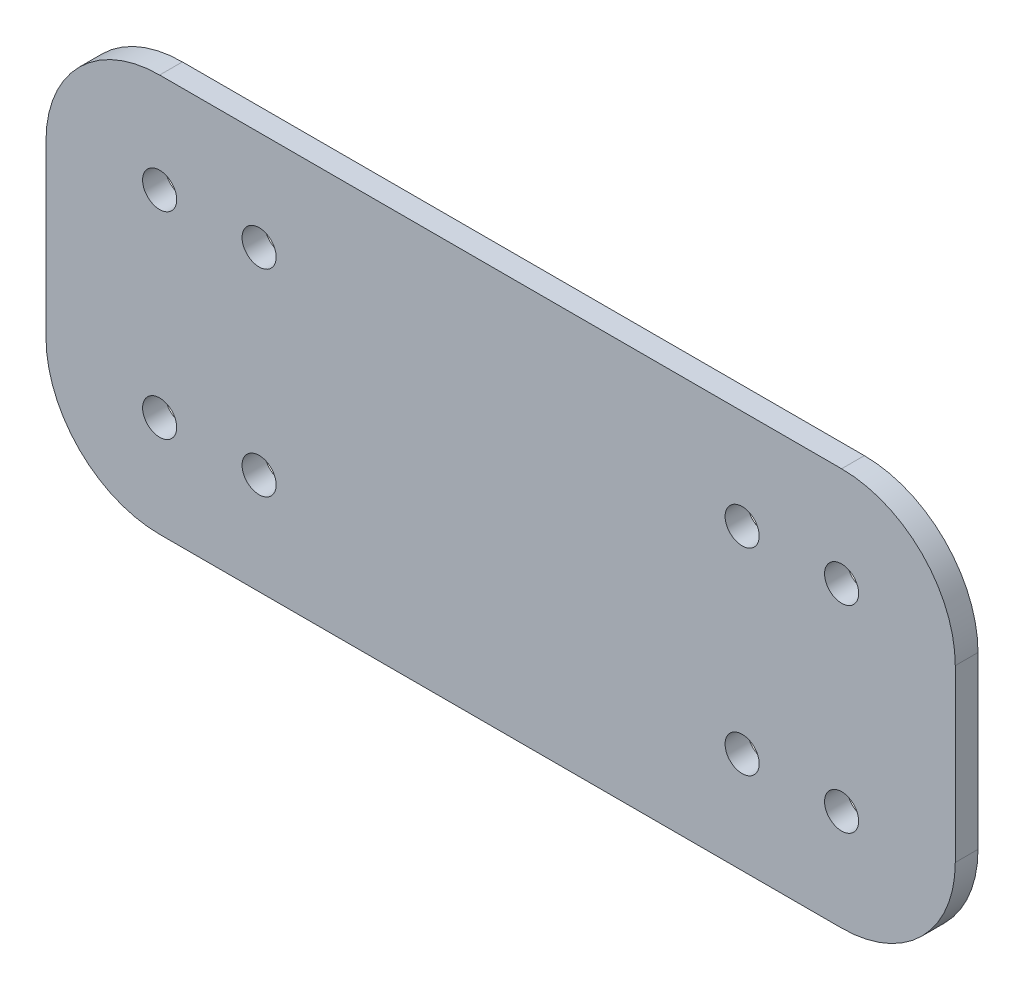
ISO-10303-21;
HEADER;
FILE_DESCRIPTION(('STEP AP214'),'2;1');
FILE_NAME('part.step','',(''),(''),'','','');
FILE_SCHEMA(('AUTOMOTIVE_DESIGN { 1 0 10303 214 1 1 1 1 }'));
ENDSEC;
DATA;
#1=APPLICATION_CONTEXT('core data for automotive mechanical design processes');
#2=APPLICATION_PROTOCOL_DEFINITION('international standard','automotive_design',2000,#1);
#3=PRODUCT_CONTEXT('',#1,'mechanical');
#4=PRODUCT('Part','Part','',(#3));
#5=PRODUCT_RELATED_PRODUCT_CATEGORY('part','',(#4));
#6=PRODUCT_DEFINITION_FORMATION('','',#4);
#7=PRODUCT_DEFINITION_CONTEXT('part definition',#1,'design');
#8=PRODUCT_DEFINITION('design','',#6,#7);
#9=PRODUCT_DEFINITION_SHAPE('','',#8);
#10=(LENGTH_UNIT() NAMED_UNIT(*) SI_UNIT(.MILLI.,.METRE.));
#11=(NAMED_UNIT(*) PLANE_ANGLE_UNIT() SI_UNIT($,.RADIAN.));
#12=(NAMED_UNIT(*) SI_UNIT($,.STERADIAN.) SOLID_ANGLE_UNIT());
#13=UNCERTAINTY_MEASURE_WITH_UNIT(LENGTH_MEASURE(1.E-05),#10,'distance_accuracy_value','');
#14=(GEOMETRIC_REPRESENTATION_CONTEXT(3) GLOBAL_UNCERTAINTY_ASSIGNED_CONTEXT((#13)) GLOBAL_UNIT_ASSIGNED_CONTEXT((#10,
#11,#12)) REPRESENTATION_CONTEXT('',''));
#15=CARTESIAN_POINT('',(0.,0.,0.));
#16=DIRECTION('',(0.,0.,1.));
#17=DIRECTION('',(1.,0.,0.));
#18=AXIS2_PLACEMENT_3D('',#15,#16,#17);
#19=CARTESIAN_POINT('',(9.63963259722495,-2.62960067748029,2.));
#20=DIRECTION('',(0.,0.,-1.));
#21=DIRECTION('',(-1.,0.,0.));
#22=AXIS2_PLACEMENT_3D('',#19,#20,#21);
#23=CYLINDRICAL_SURFACE('',#22,10.);
#24=CARTESIAN_POINT('',(9.63963259722495,-2.62960067748029,0.));
#25=DIRECTION('',(0.,0.,1.));
#26=DIRECTION('',(-1.,0.,0.));
#27=AXIS2_PLACEMENT_3D('',#24,#25,#26);
#28=CIRCLE('',#27,10.);
#29=CARTESIAN_POINT('',(9.63963259722495,-12.6296006774803,0.));
#30=VERTEX_POINT('',#29);
#31=CARTESIAN_POINT('',(19.639632597225,-2.62960067748029,0.));
#32=VERTEX_POINT('',#31);
#33=EDGE_CURVE('E140',#30,#32,#28,.T.);
#34=ORIENTED_EDGE('',*,*,#33,.T.);
#35=DIRECTION('',(0.,0.,-1.));
#36=VECTOR('',#35,1.);
#37=CARTESIAN_POINT('',(19.639632597225,-2.62960067748029,2.));
#38=LINE('',#37,#36);
#39=CARTESIAN_POINT('',(19.639632597225,-2.62960067748029,2.));
#40=VERTEX_POINT('',#39);
#41=EDGE_CURVE('E11',#40,#32,#38,.T.);
#42=ORIENTED_EDGE('',*,*,#41,.F.);
#43=CARTESIAN_POINT('',(9.63963259722495,-2.62960067748029,2.));
#44=DIRECTION('',(0.,0.,1.));
#45=DIRECTION('',(-1.,0.,0.));
#46=AXIS2_PLACEMENT_3D('',#43,#44,#45);
#47=CIRCLE('',#46,10.);
#48=CARTESIAN_POINT('',(9.63963259722495,-12.6296006774803,2.));
#49=VERTEX_POINT('',#48);
#50=EDGE_CURVE('E163',#49,#40,#47,.T.);
#51=ORIENTED_EDGE('',*,*,#50,.F.);
#52=DIRECTION('',(0.,0.,-1.));
#53=VECTOR('',#52,1.);
#54=CARTESIAN_POINT('',(9.63963259722495,-12.6296006774803,2.));
#55=LINE('',#54,#53);
#56=EDGE_CURVE('E136',#49,#30,#55,.T.);
#57=ORIENTED_EDGE('',*,*,#56,.T.);
#58=EDGE_LOOP('',(#34,#42,#51,#57));
#59=FACE_BOUND('',#58,.T.);
#60=ADVANCED_FACE('F39',(#59),#23,.T.);
#61=CARTESIAN_POINT('',(19.639632597225,12.3703993225196,2.));
#62=DIRECTION('',(-1.,0.,0.));
#63=DIRECTION('',(0.,0.,1.));
#64=AXIS2_PLACEMENT_3D('',#61,#62,#63);
#65=PLANE('',#64);
#66=DIRECTION('',(0.,1.,0.));
#67=VECTOR('',#66,1.);
#68=CARTESIAN_POINT('',(19.639632597225,12.3703993225196,0.));
#69=LINE('',#68,#67);
#70=CARTESIAN_POINT('',(19.639632597225,12.3703993225196,0.));
#71=VERTEX_POINT('',#70);
#72=EDGE_CURVE('E144',#32,#71,#69,.T.);
#73=ORIENTED_EDGE('',*,*,#72,.T.);
#74=DIRECTION('',(0.,0.,-1.));
#75=VECTOR('',#74,1.);
#76=CARTESIAN_POINT('',(19.639632597225,12.3703993225196,2.));
#77=LINE('',#76,#75);
#78=CARTESIAN_POINT('',(19.639632597225,12.3703993225196,2.));
#79=VERTEX_POINT('',#78);
#80=EDGE_CURVE('E48',#79,#71,#77,.T.);
#81=ORIENTED_EDGE('',*,*,#80,.F.);
#82=DIRECTION('',(0.,1.,0.));
#83=VECTOR('',#82,1.);
#84=CARTESIAN_POINT('',(19.639632597225,12.3703993225196,2.));
#85=LINE('',#84,#83);
#86=EDGE_CURVE('E99',#40,#79,#85,.T.);
#87=ORIENTED_EDGE('',*,*,#86,.F.);
#88=ORIENTED_EDGE('',*,*,#41,.T.);
#89=EDGE_LOOP('',(#73,#81,#87,#88));
#90=FACE_BOUND('',#89,.T.);
#91=ADVANCED_FACE('F304',(#90),#65,.F.);
#92=CARTESIAN_POINT('',(9.63963259722495,12.3703993225196,2.));
#93=DIRECTION('',(0.,0.,-1.));
#94=DIRECTION('',(-1.,0.,0.));
#95=AXIS2_PLACEMENT_3D('',#92,#93,#94);
#96=CYLINDRICAL_SURFACE('',#95,10.);
#97=CARTESIAN_POINT('',(9.63963259722495,12.3703993225196,0.));
#98=DIRECTION('',(0.,0.,1.));
#99=DIRECTION('',(-1.,0.,0.));
#100=AXIS2_PLACEMENT_3D('',#97,#98,#99);
#101=CIRCLE('',#100,10.);
#102=CARTESIAN_POINT('',(9.63963259722495,22.3703993225196,0.));
#103=VERTEX_POINT('',#102);
#104=EDGE_CURVE('E148',#71,#103,#101,.T.);
#105=ORIENTED_EDGE('',*,*,#104,.T.);
#106=DIRECTION('',(0.,0.,-1.));
#107=VECTOR('',#106,1.);
#108=CARTESIAN_POINT('',(9.63963259722495,22.3703993225196,2.));
#109=LINE('',#108,#107);
#110=CARTESIAN_POINT('',(9.63963259722495,22.3703993225196,2.));
#111=VERTEX_POINT('',#110);
#112=EDGE_CURVE('E174',#111,#103,#109,.T.);
#113=ORIENTED_EDGE('',*,*,#112,.F.);
#114=CARTESIAN_POINT('',(9.63963259722495,12.3703993225196,2.));
#115=DIRECTION('',(0.,0.,1.));
#116=DIRECTION('',(-1.,0.,0.));
#117=AXIS2_PLACEMENT_3D('',#114,#115,#116);
#118=CIRCLE('',#117,10.);
#119=EDGE_CURVE('E184',#79,#111,#118,.T.);
#120=ORIENTED_EDGE('',*,*,#119,.F.);
#121=ORIENTED_EDGE('',*,*,#80,.T.);
#122=EDGE_LOOP('',(#105,#113,#120,#121));
#123=FACE_BOUND('',#122,.T.);
#124=ADVANCED_FACE('F182',(#123),#96,.T.);
#125=CARTESIAN_POINT('',(-50.360367402775,22.3703993225197,2.));
#126=DIRECTION('',(0.,-1.,0.));
#127=DIRECTION('',(1.,0.,0.));
#128=AXIS2_PLACEMENT_3D('',#125,#126,#127);
#129=PLANE('',#128);
#130=DIRECTION('',(-1.,0.,0.));
#131=VECTOR('',#130,1.);
#132=CARTESIAN_POINT('',(-50.360367402775,22.3703993225197,0.));
#133=LINE('',#132,#131);
#134=CARTESIAN_POINT('',(-50.360367402775,22.3703993225197,0.));
#135=VERTEX_POINT('',#134);
#136=EDGE_CURVE('E151',#103,#135,#133,.T.);
#137=ORIENTED_EDGE('',*,*,#136,.T.);
#138=DIRECTION('',(0.,0.,-1.));
#139=VECTOR('',#138,1.);
#140=CARTESIAN_POINT('',(-50.360367402775,22.3703993225197,2.));
#141=LINE('',#140,#139);
#142=CARTESIAN_POINT('',(-50.360367402775,22.3703993225197,2.));
#143=VERTEX_POINT('',#142);
#144=EDGE_CURVE('E170',#143,#135,#141,.T.);
#145=ORIENTED_EDGE('',*,*,#144,.F.);
#146=DIRECTION('',(-1.,0.,0.));
#147=VECTOR('',#146,1.);
#148=CARTESIAN_POINT('',(-50.360367402775,22.3703993225197,2.));
#149=LINE('',#148,#147);
#150=EDGE_CURVE('E197',#111,#143,#149,.T.);
#151=ORIENTED_EDGE('',*,*,#150,.F.);
#152=ORIENTED_EDGE('',*,*,#112,.T.);
#153=EDGE_LOOP('',(#137,#145,#151,#152));
#154=FACE_BOUND('',#153,.T.);
#155=ADVANCED_FACE('F192',(#154),#129,.F.);
#156=CARTESIAN_POINT('',(-50.3603674027751,12.3703993225197,2.));
#157=DIRECTION('',(0.,0.,-1.));
#158=DIRECTION('',(-1.,0.,0.));
#159=AXIS2_PLACEMENT_3D('',#156,#157,#158);
#160=CYLINDRICAL_SURFACE('',#159,10.);
#161=CARTESIAN_POINT('',(-50.3603674027751,12.3703993225197,0.));
#162=DIRECTION('',(0.,0.,1.));
#163=DIRECTION('',(1.,0.,0.));
#164=AXIS2_PLACEMENT_3D('',#161,#162,#163);
#165=CIRCLE('',#164,10.);
#166=CARTESIAN_POINT('',(-60.3603674027751,12.3703993225196,0.));
#167=VERTEX_POINT('',#166);
#168=EDGE_CURVE('E154',#135,#167,#165,.T.);
#169=ORIENTED_EDGE('',*,*,#168,.T.);
#170=DIRECTION('',(0.,0.,-1.));
#171=VECTOR('',#170,1.);
#172=CARTESIAN_POINT('',(-60.3603674027751,12.3703993225196,2.));
#173=LINE('',#172,#171);
#174=CARTESIAN_POINT('',(-60.3603674027751,12.3703993225196,2.));
#175=VERTEX_POINT('',#174);
#176=EDGE_CURVE('E129',#175,#167,#173,.T.);
#177=ORIENTED_EDGE('',*,*,#176,.F.);
#178=CARTESIAN_POINT('',(-50.3603674027751,12.3703993225197,2.));
#179=DIRECTION('',(0.,0.,1.));
#180=DIRECTION('',(1.,0.,0.));
#181=AXIS2_PLACEMENT_3D('',#178,#179,#180);
#182=CIRCLE('',#181,10.);
#183=EDGE_CURVE('E118',#143,#175,#182,.T.);
#184=ORIENTED_EDGE('',*,*,#183,.F.);
#185=ORIENTED_EDGE('',*,*,#144,.T.);
#186=EDGE_LOOP('',(#169,#177,#184,#185));
#187=FACE_BOUND('',#186,.T.);
#188=ADVANCED_FACE('F195',(#187),#160,.T.);
#189=CARTESIAN_POINT('',(-60.3603674027751,-2.62960067748023,2.));
#190=DIRECTION('',(1.,0.,0.));
#191=DIRECTION('',(0.,0.,-1.));
#192=AXIS2_PLACEMENT_3D('',#189,#190,#191);
#193=PLANE('',#192);
#194=DIRECTION('',(0.,-1.,0.));
#195=VECTOR('',#194,1.);
#196=CARTESIAN_POINT('',(-60.3603674027751,-2.62960067748023,0.));
#197=LINE('',#196,#195);
#198=CARTESIAN_POINT('',(-60.3603674027751,-2.62960067748023,0.));
#199=VERTEX_POINT('',#198);
#200=EDGE_CURVE('E127',#167,#199,#197,.T.);
#201=ORIENTED_EDGE('',*,*,#200,.T.);
#202=DIRECTION('',(0.,0.,-1.));
#203=VECTOR('',#202,1.);
#204=CARTESIAN_POINT('',(-60.3603674027751,-2.62960067748023,2.));
#205=LINE('',#204,#203);
#206=CARTESIAN_POINT('',(-60.3603674027751,-2.62960067748023,2.));
#207=VERTEX_POINT('',#206);
#208=EDGE_CURVE('E124',#207,#199,#205,.T.);
#209=ORIENTED_EDGE('',*,*,#208,.F.);
#210=DIRECTION('',(0.,-1.,0.));
#211=VECTOR('',#210,1.);
#212=CARTESIAN_POINT('',(-60.3603674027751,-2.62960067748023,2.));
#213=LINE('',#212,#211);
#214=EDGE_CURVE('E112',#175,#207,#213,.T.);
#215=ORIENTED_EDGE('',*,*,#214,.F.);
#216=ORIENTED_EDGE('',*,*,#176,.T.);
#217=EDGE_LOOP('',(#201,#209,#215,#216));
#218=FACE_BOUND('',#217,.T.);
#219=ADVANCED_FACE('F125',(#218),#193,.F.);
#220=CARTESIAN_POINT('',(-50.3603674027751,-2.6296006774803,2.));
#221=DIRECTION('',(0.,0.,-1.));
#222=DIRECTION('',(-1.,0.,0.));
#223=AXIS2_PLACEMENT_3D('',#220,#221,#222);
#224=CYLINDRICAL_SURFACE('',#223,10.);
#225=CARTESIAN_POINT('',(-50.3603674027751,-2.6296006774803,0.));
#226=DIRECTION('',(0.,0.,1.));
#227=DIRECTION('',(-1.,0.,0.));
#228=AXIS2_PLACEMENT_3D('',#225,#226,#227);
#229=CIRCLE('',#228,10.);
#230=CARTESIAN_POINT('',(-50.360367402775,-12.6296006774803,0.));
#231=VERTEX_POINT('',#230);
#232=EDGE_CURVE('E85',#199,#231,#229,.T.);
#233=ORIENTED_EDGE('',*,*,#232,.T.);
#234=DIRECTION('',(0.,0.,-1.));
#235=VECTOR('',#234,1.);
#236=CARTESIAN_POINT('',(-50.360367402775,-12.6296006774803,2.));
#237=LINE('',#236,#235);
#238=CARTESIAN_POINT('',(-50.360367402775,-12.6296006774803,2.));
#239=VERTEX_POINT('',#238);
#240=EDGE_CURVE('E130',#239,#231,#237,.T.);
#241=ORIENTED_EDGE('',*,*,#240,.F.);
#242=CARTESIAN_POINT('',(-50.3603674027751,-2.6296006774803,2.));
#243=DIRECTION('',(0.,0.,1.));
#244=DIRECTION('',(-1.,0.,0.));
#245=AXIS2_PLACEMENT_3D('',#242,#243,#244);
#246=CIRCLE('',#245,10.);
#247=EDGE_CURVE('E116',#207,#239,#246,.T.);
#248=ORIENTED_EDGE('',*,*,#247,.F.);
#249=ORIENTED_EDGE('',*,*,#208,.T.);
#250=EDGE_LOOP('',(#233,#241,#248,#249));
#251=FACE_BOUND('',#250,.T.);
#252=ADVANCED_FACE('F132',(#251),#224,.T.);
#253=CARTESIAN_POINT('',(9.63963259722495,-12.6296006774803,2.));
#254=DIRECTION('',(0.,1.,0.));
#255=DIRECTION('',(-1.,0.,0.));
#256=AXIS2_PLACEMENT_3D('',#253,#254,#255);
#257=PLANE('',#256);
#258=DIRECTION('',(1.,0.,0.));
#259=VECTOR('',#258,1.);
#260=CARTESIAN_POINT('',(9.63963259722495,-12.6296006774803,0.));
#261=LINE('',#260,#259);
#262=EDGE_CURVE('E91',#231,#30,#261,.T.);
#263=ORIENTED_EDGE('',*,*,#262,.T.);
#264=ORIENTED_EDGE('',*,*,#56,.F.);
#265=DIRECTION('',(1.,0.,0.));
#266=VECTOR('',#265,1.);
#267=CARTESIAN_POINT('',(9.63963259722495,-12.6296006774803,2.));
#268=LINE('',#267,#266);
#269=EDGE_CURVE('E56',#239,#49,#268,.T.);
#270=ORIENTED_EDGE('',*,*,#269,.F.);
#271=ORIENTED_EDGE('',*,*,#240,.T.);
#272=EDGE_LOOP('',(#263,#264,#270,#271));
#273=FACE_BOUND('',#272,.T.);
#274=ADVANCED_FACE('F311',(#273),#257,.F.);
#275=CARTESIAN_POINT('',(9.63963259722495,-2.62960067748029,2.));
#276=DIRECTION('',(0.,0.,-1.));
#277=DIRECTION('',(-1.,0.,0.));
#278=AXIS2_PLACEMENT_3D('',#275,#276,#277);
#279=PLANE('',#278);
#280=CARTESIAN_POINT('',(9.63963259722495,13.6203993225197,2.));
#281=DIRECTION('',(0.,0.,-1.));
#282=DIRECTION('',(-1.,0.,0.));
#283=AXIS2_PLACEMENT_3D('',#280,#281,#282);
#284=CIRCLE('',#283,1.5);
#285=CARTESIAN_POINT('',(8.13963259722495,13.6203993225197,2.));
#286=VERTEX_POINT('',#285);
#287=EDGE_CURVE('E262',#286,#286,#284,.T.);
#288=ORIENTED_EDGE('',*,*,#287,.T.);
#289=EDGE_LOOP('',(#288));
#290=FACE_BOUND('',#289,.T.);
#291=CARTESIAN_POINT('',(0.889632597224937,13.6203993225197,2.));
#292=DIRECTION('',(0.,0.,-1.));
#293=DIRECTION('',(-1.,0.,0.));
#294=AXIS2_PLACEMENT_3D('',#291,#292,#293);
#295=CIRCLE('',#294,1.5);
#296=CARTESIAN_POINT('',(-0.610367402775062,13.6203993225197,2.));
#297=VERTEX_POINT('',#296);
#298=EDGE_CURVE('E254',#297,#297,#295,.T.);
#299=ORIENTED_EDGE('',*,*,#298,.T.);
#300=EDGE_LOOP('',(#299));
#301=FACE_BOUND('',#300,.T.);
#302=CARTESIAN_POINT('',(0.889632597224937,-3.73217799081905,2.));
#303=DIRECTION('',(0.,0.,-1.));
#304=DIRECTION('',(-1.,0.,0.));
#305=AXIS2_PLACEMENT_3D('',#302,#303,#304);
#306=CIRCLE('',#305,1.5);
#307=CARTESIAN_POINT('',(-0.610367402775062,-3.73217799081905,2.));
#308=VERTEX_POINT('',#307);
#309=EDGE_CURVE('E246',#308,#308,#306,.T.);
#310=ORIENTED_EDGE('',*,*,#309,.T.);
#311=EDGE_LOOP('',(#310));
#312=FACE_BOUND('',#311,.T.);
#313=CARTESIAN_POINT('',(9.63963259722492,-3.73217799081905,2.));
#314=DIRECTION('',(0.,0.,-1.));
#315=DIRECTION('',(-1.,0.,0.));
#316=AXIS2_PLACEMENT_3D('',#313,#314,#315);
#317=CIRCLE('',#316,1.5);
#318=CARTESIAN_POINT('',(8.13963259722492,-3.73217799081905,2.));
#319=VERTEX_POINT('',#318);
#320=EDGE_CURVE('E238',#319,#319,#317,.T.);
#321=ORIENTED_EDGE('',*,*,#320,.T.);
#322=EDGE_LOOP('',(#321));
#323=FACE_BOUND('',#322,.T.);
#324=CARTESIAN_POINT('',(-41.610367402775,13.6203993225197,2.));
#325=DIRECTION('',(0.,0.,-1.));
#326=DIRECTION('',(-1.,0.,0.));
#327=AXIS2_PLACEMENT_3D('',#324,#325,#326);
#328=CIRCLE('',#327,1.5);
#329=CARTESIAN_POINT('',(-43.110367402775,13.6203993225197,2.));
#330=VERTEX_POINT('',#329);
#331=EDGE_CURVE('E230',#330,#330,#328,.T.);
#332=ORIENTED_EDGE('',*,*,#331,.T.);
#333=EDGE_LOOP('',(#332));
#334=FACE_BOUND('',#333,.T.);
#335=CARTESIAN_POINT('',(-50.360367402775,13.6203993225197,2.));
#336=DIRECTION('',(0.,0.,-1.));
#337=DIRECTION('',(-1.,0.,0.));
#338=AXIS2_PLACEMENT_3D('',#335,#336,#337);
#339=CIRCLE('',#338,1.5);
#340=CARTESIAN_POINT('',(-51.860367402775,13.6203993225197,2.));
#341=VERTEX_POINT('',#340);
#342=EDGE_CURVE('E222',#341,#341,#339,.T.);
#343=ORIENTED_EDGE('',*,*,#342,.T.);
#344=EDGE_LOOP('',(#343));
#345=FACE_BOUND('',#344,.T.);
#346=CARTESIAN_POINT('',(-41.610367402775,-3.73217799081904,2.));
#347=DIRECTION('',(0.,0.,-1.));
#348=DIRECTION('',(-1.,0.,0.));
#349=AXIS2_PLACEMENT_3D('',#346,#347,#348);
#350=CIRCLE('',#349,1.5);
#351=CARTESIAN_POINT('',(-43.110367402775,-3.73217799081904,2.));
#352=VERTEX_POINT('',#351);
#353=EDGE_CURVE('E214',#352,#352,#350,.T.);
#354=ORIENTED_EDGE('',*,*,#353,.T.);
#355=EDGE_LOOP('',(#354));
#356=FACE_BOUND('',#355,.T.);
#357=CARTESIAN_POINT('',(-50.360367402775,-3.73217799081904,2.));
#358=DIRECTION('',(0.,0.,-1.));
#359=DIRECTION('',(-1.,0.,0.));
#360=AXIS2_PLACEMENT_3D('',#357,#358,#359);
#361=CIRCLE('',#360,1.5);
#362=CARTESIAN_POINT('',(-51.860367402775,-3.73217799081904,2.));
#363=VERTEX_POINT('',#362);
#364=EDGE_CURVE('E145',#363,#363,#361,.T.);
#365=ORIENTED_EDGE('',*,*,#364,.T.);
#366=EDGE_LOOP('',(#365));
#367=FACE_BOUND('',#366,.T.);
#368=ORIENTED_EDGE('',*,*,#50,.T.);
#369=ORIENTED_EDGE('',*,*,#86,.T.);
#370=ORIENTED_EDGE('',*,*,#119,.T.);
#371=ORIENTED_EDGE('',*,*,#150,.T.);
#372=ORIENTED_EDGE('',*,*,#183,.T.);
#373=ORIENTED_EDGE('',*,*,#214,.T.);
#374=ORIENTED_EDGE('',*,*,#247,.T.);
#375=ORIENTED_EDGE('',*,*,#269,.T.);
#376=EDGE_LOOP('',(#368,#369,#370,#371,#372,#373,#374,#375));
#377=FACE_BOUND('',#376,.T.);
#378=ADVANCED_FACE('F114',(#290,#301,#312,#323,#334,#345,#356,#367,#377),#279,.F.);
#379=CARTESIAN_POINT('',(9.63963259722495,-2.62960067748029,0.));
#380=DIRECTION('',(0.,0.,-1.));
#381=DIRECTION('',(-1.,0.,0.));
#382=AXIS2_PLACEMENT_3D('',#379,#380,#381);
#383=PLANE('',#382);
#384=CARTESIAN_POINT('',(9.63963259722495,13.6203993225197,0.));
#385=DIRECTION('',(0.,0.,-1.));
#386=DIRECTION('',(-1.,0.,0.));
#387=AXIS2_PLACEMENT_3D('',#384,#385,#386);
#388=CIRCLE('',#387,1.49999999999999);
#389=CARTESIAN_POINT('',(8.13963259722496,13.6203993225197,0.));
#390=VERTEX_POINT('',#389);
#391=EDGE_CURVE('E266',#390,#390,#388,.T.);
#392=ORIENTED_EDGE('',*,*,#391,.F.);
#393=EDGE_LOOP('',(#392));
#394=FACE_BOUND('',#393,.T.);
#395=CARTESIAN_POINT('',(0.889632597224937,13.6203993225197,0.));
#396=DIRECTION('',(0.,0.,-1.));
#397=DIRECTION('',(-1.,0.,0.));
#398=AXIS2_PLACEMENT_3D('',#395,#396,#397);
#399=CIRCLE('',#398,1.49999999999999);
#400=CARTESIAN_POINT('',(-0.61036740277505,13.6203993225197,0.));
#401=VERTEX_POINT('',#400);
#402=EDGE_CURVE('E258',#401,#401,#399,.T.);
#403=ORIENTED_EDGE('',*,*,#402,.F.);
#404=EDGE_LOOP('',(#403));
#405=FACE_BOUND('',#404,.T.);
#406=CARTESIAN_POINT('',(0.889632597224937,-3.73217799081905,0.));
#407=DIRECTION('',(0.,0.,-1.));
#408=DIRECTION('',(-1.,0.,0.));
#409=AXIS2_PLACEMENT_3D('',#406,#407,#408);
#410=CIRCLE('',#409,1.49999999999999);
#411=CARTESIAN_POINT('',(-0.61036740277505,-3.73217799081905,0.));
#412=VERTEX_POINT('',#411);
#413=EDGE_CURVE('E250',#412,#412,#410,.T.);
#414=ORIENTED_EDGE('',*,*,#413,.F.);
#415=EDGE_LOOP('',(#414));
#416=FACE_BOUND('',#415,.T.);
#417=CARTESIAN_POINT('',(9.63963259722492,-3.73217799081905,0.));
#418=DIRECTION('',(0.,0.,-1.));
#419=DIRECTION('',(-1.,0.,0.));
#420=AXIS2_PLACEMENT_3D('',#417,#418,#419);
#421=CIRCLE('',#420,1.49999999999999);
#422=CARTESIAN_POINT('',(8.13963259722493,-3.73217799081905,0.));
#423=VERTEX_POINT('',#422);
#424=EDGE_CURVE('E242',#423,#423,#421,.T.);
#425=ORIENTED_EDGE('',*,*,#424,.F.);
#426=EDGE_LOOP('',(#425));
#427=FACE_BOUND('',#426,.T.);
#428=CARTESIAN_POINT('',(-41.610367402775,13.6203993225197,0.));
#429=DIRECTION('',(0.,0.,-1.));
#430=DIRECTION('',(-1.,0.,0.));
#431=AXIS2_PLACEMENT_3D('',#428,#429,#430);
#432=CIRCLE('',#431,1.5);
#433=CARTESIAN_POINT('',(-43.110367402775,13.6203993225197,0.));
#434=VERTEX_POINT('',#433);
#435=EDGE_CURVE('E234',#434,#434,#432,.T.);
#436=ORIENTED_EDGE('',*,*,#435,.F.);
#437=EDGE_LOOP('',(#436));
#438=FACE_BOUND('',#437,.T.);
#439=CARTESIAN_POINT('',(-50.360367402775,13.6203993225197,0.));
#440=DIRECTION('',(0.,0.,-1.));
#441=DIRECTION('',(-1.,0.,0.));
#442=AXIS2_PLACEMENT_3D('',#439,#440,#441);
#443=CIRCLE('',#442,1.5);
#444=CARTESIAN_POINT('',(-51.860367402775,13.6203993225197,0.));
#445=VERTEX_POINT('',#444);
#446=EDGE_CURVE('E226',#445,#445,#443,.T.);
#447=ORIENTED_EDGE('',*,*,#446,.F.);
#448=EDGE_LOOP('',(#447));
#449=FACE_BOUND('',#448,.T.);
#450=CARTESIAN_POINT('',(-41.610367402775,-3.73217799081904,0.));
#451=DIRECTION('',(0.,0.,-1.));
#452=DIRECTION('',(-1.,0.,0.));
#453=AXIS2_PLACEMENT_3D('',#450,#451,#452);
#454=CIRCLE('',#453,1.5);
#455=CARTESIAN_POINT('',(-43.110367402775,-3.73217799081904,0.));
#456=VERTEX_POINT('',#455);
#457=EDGE_CURVE('E218',#456,#456,#454,.T.);
#458=ORIENTED_EDGE('',*,*,#457,.F.);
#459=EDGE_LOOP('',(#458));
#460=FACE_BOUND('',#459,.T.);
#461=CARTESIAN_POINT('',(-50.360367402775,-3.73217799081904,0.));
#462=DIRECTION('',(0.,0.,-1.));
#463=DIRECTION('',(-1.,0.,0.));
#464=AXIS2_PLACEMENT_3D('',#461,#462,#463);
#465=CIRCLE('',#464,1.5);
#466=CARTESIAN_POINT('',(-51.860367402775,-3.73217799081904,0.));
#467=VERTEX_POINT('',#466);
#468=EDGE_CURVE('E210',#467,#467,#465,.T.);
#469=ORIENTED_EDGE('',*,*,#468,.F.);
#470=EDGE_LOOP('',(#469));
#471=FACE_BOUND('',#470,.T.);
#472=ORIENTED_EDGE('',*,*,#33,.F.);
#473=ORIENTED_EDGE('',*,*,#262,.F.);
#474=ORIENTED_EDGE('',*,*,#232,.F.);
#475=ORIENTED_EDGE('',*,*,#200,.F.);
#476=ORIENTED_EDGE('',*,*,#168,.F.);
#477=ORIENTED_EDGE('',*,*,#136,.F.);
#478=ORIENTED_EDGE('',*,*,#104,.F.);
#479=ORIENTED_EDGE('',*,*,#72,.F.);
#480=EDGE_LOOP('',(#472,#473,#474,#475,#476,#477,#478,#479));
#481=FACE_BOUND('',#480,.T.);
#482=ADVANCED_FACE('F188',(#394,#405,#416,#427,#438,#449,#460,#471,#481),#383,.T.);
#483=CARTESIAN_POINT('',(-50.360367402775,-3.73217799081904,0.));
#484=DIRECTION('',(0.,0.,-1.));
#485=DIRECTION('',(-1.,0.,0.));
#486=AXIS2_PLACEMENT_3D('',#483,#484,#485);
#487=CYLINDRICAL_SURFACE('',#486,1.5);
#488=ORIENTED_EDGE('',*,*,#364,.F.);
#489=EDGE_LOOP('',(#488));
#490=FACE_BOUND('',#489,.T.);
#491=ORIENTED_EDGE('',*,*,#468,.T.);
#492=EDGE_LOOP('',(#491));
#493=FACE_BOUND('',#492,.T.);
#494=ADVANCED_FACE('F275',(#490,#493),#487,.F.);
#495=CARTESIAN_POINT('',(-41.610367402775,-3.73217799081904,0.));
#496=DIRECTION('',(0.,0.,-1.));
#497=DIRECTION('',(-1.,0.,0.));
#498=AXIS2_PLACEMENT_3D('',#495,#496,#497);
#499=CYLINDRICAL_SURFACE('',#498,1.5);
#500=ORIENTED_EDGE('',*,*,#353,.F.);
#501=EDGE_LOOP('',(#500));
#502=FACE_BOUND('',#501,.T.);
#503=ORIENTED_EDGE('',*,*,#457,.T.);
#504=EDGE_LOOP('',(#503));
#505=FACE_BOUND('',#504,.T.);
#506=ADVANCED_FACE('F292',(#502,#505),#499,.F.);
#507=CARTESIAN_POINT('',(-50.360367402775,13.6203993225197,0.));
#508=DIRECTION('',(0.,0.,-1.));
#509=DIRECTION('',(-1.,0.,0.));
#510=AXIS2_PLACEMENT_3D('',#507,#508,#509);
#511=CYLINDRICAL_SURFACE('',#510,1.5);
#512=ORIENTED_EDGE('',*,*,#342,.F.);
#513=EDGE_LOOP('',(#512));
#514=FACE_BOUND('',#513,.T.);
#515=ORIENTED_EDGE('',*,*,#446,.T.);
#516=EDGE_LOOP('',(#515));
#517=FACE_BOUND('',#516,.T.);
#518=ADVANCED_FACE('F298',(#514,#517),#511,.F.);
#519=CARTESIAN_POINT('',(-41.610367402775,13.6203993225197,0.));
#520=DIRECTION('',(0.,0.,-1.));
#521=DIRECTION('',(-1.,0.,0.));
#522=AXIS2_PLACEMENT_3D('',#519,#520,#521);
#523=CYLINDRICAL_SURFACE('',#522,1.5);
#524=ORIENTED_EDGE('',*,*,#331,.F.);
#525=EDGE_LOOP('',(#524));
#526=FACE_BOUND('',#525,.T.);
#527=ORIENTED_EDGE('',*,*,#435,.T.);
#528=EDGE_LOOP('',(#527));
#529=FACE_BOUND('',#528,.T.);
#530=ADVANCED_FACE('F373',(#526,#529),#523,.F.);
#531=CARTESIAN_POINT('',(9.63963259722492,-3.73217799081905,0.));
#532=DIRECTION('',(0.,0.,-1.));
#533=DIRECTION('',(-1.,0.,0.));
#534=AXIS2_PLACEMENT_3D('',#531,#532,#533);
#535=CYLINDRICAL_SURFACE('',#534,1.49999999999999);
#536=ORIENTED_EDGE('',*,*,#320,.F.);
#537=EDGE_LOOP('',(#536));
#538=FACE_BOUND('',#537,.T.);
#539=ORIENTED_EDGE('',*,*,#424,.T.);
#540=EDGE_LOOP('',(#539));
#541=FACE_BOUND('',#540,.T.);
#542=ADVANCED_FACE('F383',(#538,#541),#535,.F.);
#543=CARTESIAN_POINT('',(0.889632597224937,-3.73217799081905,0.));
#544=DIRECTION('',(0.,0.,-1.));
#545=DIRECTION('',(-1.,0.,0.));
#546=AXIS2_PLACEMENT_3D('',#543,#544,#545);
#547=CYLINDRICAL_SURFACE('',#546,1.49999999999999);
#548=ORIENTED_EDGE('',*,*,#309,.F.);
#549=EDGE_LOOP('',(#548));
#550=FACE_BOUND('',#549,.T.);
#551=ORIENTED_EDGE('',*,*,#413,.T.);
#552=EDGE_LOOP('',(#551));
#553=FACE_BOUND('',#552,.T.);
#554=ADVANCED_FACE('F403',(#550,#553),#547,.F.);
#555=CARTESIAN_POINT('',(0.889632597224937,13.6203993225197,0.));
#556=DIRECTION('',(0.,0.,-1.));
#557=DIRECTION('',(-1.,0.,0.));
#558=AXIS2_PLACEMENT_3D('',#555,#556,#557);
#559=CYLINDRICAL_SURFACE('',#558,1.49999999999999);
#560=ORIENTED_EDGE('',*,*,#298,.F.);
#561=EDGE_LOOP('',(#560));
#562=FACE_BOUND('',#561,.T.);
#563=ORIENTED_EDGE('',*,*,#402,.T.);
#564=EDGE_LOOP('',(#563));
#565=FACE_BOUND('',#564,.T.);
#566=ADVANCED_FACE('F413',(#562,#565),#559,.F.);
#567=CARTESIAN_POINT('',(9.63963259722495,13.6203993225197,0.));
#568=DIRECTION('',(0.,0.,-1.));
#569=DIRECTION('',(-1.,0.,0.));
#570=AXIS2_PLACEMENT_3D('',#567,#568,#569);
#571=CYLINDRICAL_SURFACE('',#570,1.49999999999999);
#572=ORIENTED_EDGE('',*,*,#287,.F.);
#573=EDGE_LOOP('',(#572));
#574=FACE_BOUND('',#573,.T.);
#575=ORIENTED_EDGE('',*,*,#391,.T.);
#576=EDGE_LOOP('',(#575));
#577=FACE_BOUND('',#576,.T.);
#578=ADVANCED_FACE('F271',(#574,#577),#571,.F.);
#579=CLOSED_SHELL('',(#60,#91,#124,#155,#188,#219,#252,#274,#378,#482,#494,#506,#518,#530,#542,
#554,#566,#578));
#580=MANIFOLD_SOLID_BREP('B2',#579);
#581=ADVANCED_BREP_SHAPE_REPRESENTATION('',(#18,#580),#14);
#582=SHAPE_DEFINITION_REPRESENTATION(#9,#581);
ENDSEC;
END-ISO-10303-21;
